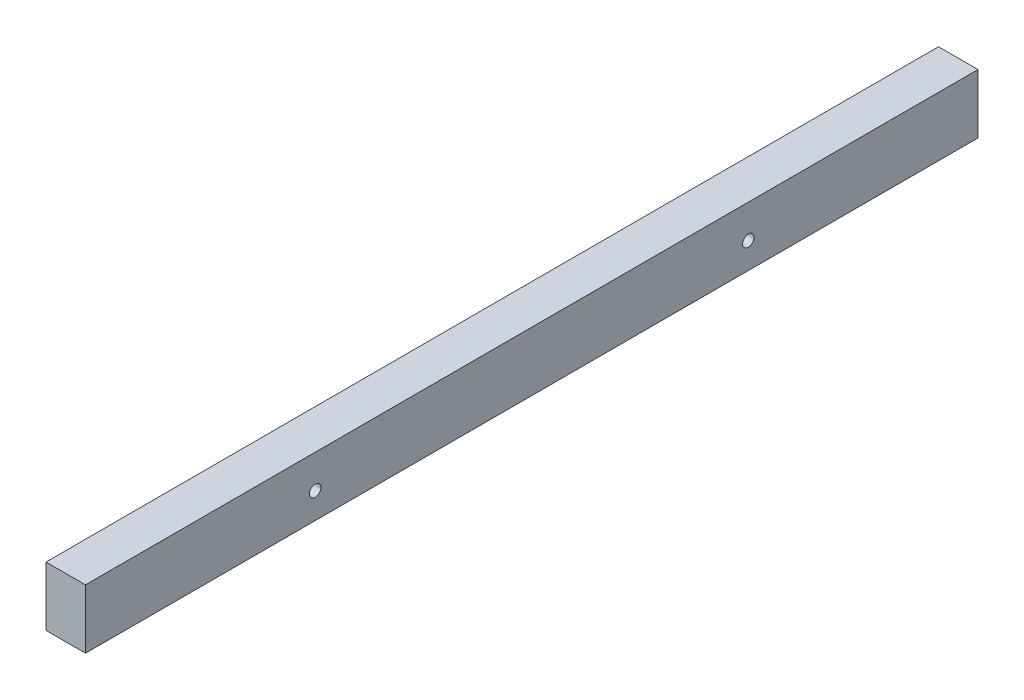
ISO-10303-21;
HEADER;
FILE_DESCRIPTION(('STEP AP214'),'2;1');
FILE_NAME('part.step','',(''),(''),'','','');
FILE_SCHEMA(('AUTOMOTIVE_DESIGN { 1 0 10303 214 1 1 1 1 }'));
ENDSEC;
DATA;
#1=APPLICATION_CONTEXT('core data for automotive mechanical design processes');
#2=APPLICATION_PROTOCOL_DEFINITION('international standard','automotive_design',2000,#1);
#3=PRODUCT_CONTEXT('',#1,'mechanical');
#4=PRODUCT('Part','Part','',(#3));
#5=PRODUCT_RELATED_PRODUCT_CATEGORY('part','',(#4));
#6=PRODUCT_DEFINITION_FORMATION('','',#4);
#7=PRODUCT_DEFINITION_CONTEXT('part definition',#1,'design');
#8=PRODUCT_DEFINITION('design','',#6,#7);
#9=PRODUCT_DEFINITION_SHAPE('','',#8);
#10=(LENGTH_UNIT() NAMED_UNIT(*) SI_UNIT(.MILLI.,.METRE.));
#11=(NAMED_UNIT(*) PLANE_ANGLE_UNIT() SI_UNIT($,.RADIAN.));
#12=(NAMED_UNIT(*) SI_UNIT($,.STERADIAN.) SOLID_ANGLE_UNIT());
#13=UNCERTAINTY_MEASURE_WITH_UNIT(LENGTH_MEASURE(1.E-05),#10,'distance_accuracy_value','');
#14=(GEOMETRIC_REPRESENTATION_CONTEXT(3) GLOBAL_UNCERTAINTY_ASSIGNED_CONTEXT((#13)) GLOBAL_UNIT_ASSIGNED_CONTEXT((#10,
#11,#12)) REPRESENTATION_CONTEXT('',''));
#15=CARTESIAN_POINT('',(0.,0.,0.));
#16=DIRECTION('',(0.,0.,1.));
#17=DIRECTION('',(1.,0.,0.));
#18=AXIS2_PLACEMENT_3D('',#15,#16,#17);
#19=CARTESIAN_POINT('',(0.,0.,287.02));
#20=DIRECTION('',(1.,0.,0.));
#21=DIRECTION('',(0.,0.,-1.));
#22=AXIS2_PLACEMENT_3D('',#19,#20,#21);
#23=PLANE('',#22);
#24=CARTESIAN_POINT('',(0.,8.34314575050762,213.166854249492));
#25=DIRECTION('',(1.,0.,0.));
#26=DIRECTION('',(0.,0.,-1.));
#27=AXIS2_PLACEMENT_3D('',#24,#25,#26);
#28=CIRCLE('',#27,1.85);
#29=CARTESIAN_POINT('',(0.,8.34314575050762,211.316854249492));
#30=VERTEX_POINT('',#29);
#31=EDGE_CURVE('E124',#30,#30,#28,.T.);
#32=ORIENTED_EDGE('',*,*,#31,.T.);
#33=EDGE_LOOP('',(#32));
#34=FACE_BOUND('',#33,.T.);
#35=CARTESIAN_POINT('',(0.,8.34314575050762,73.853145750508));
#36=DIRECTION('',(1.,0.,0.));
#37=DIRECTION('',(0.,0.,-1.));
#38=AXIS2_PLACEMENT_3D('',#35,#36,#37);
#39=CIRCLE('',#38,1.84999999999999);
#40=CARTESIAN_POINT('',(0.,8.34314575050762,72.003145750508));
#41=VERTEX_POINT('',#40);
#42=EDGE_CURVE('E110',#41,#41,#39,.T.);
#43=ORIENTED_EDGE('',*,*,#42,.T.);
#44=EDGE_LOOP('',(#43));
#45=FACE_BOUND('',#44,.T.);
#46=DIRECTION('',(0.,-1.,0.));
#47=VECTOR('',#46,1.);
#48=CARTESIAN_POINT('',(0.,0.,0.));
#49=LINE('',#48,#47);
#50=CARTESIAN_POINT('',(0.,19.05,0.));
#51=VERTEX_POINT('',#50);
#52=CARTESIAN_POINT('',(0.,0.,0.));
#53=VERTEX_POINT('',#52);
#54=EDGE_CURVE('E107',#51,#53,#49,.T.);
#55=ORIENTED_EDGE('',*,*,#54,.T.);
#56=DIRECTION('',(0.,0.,-1.));
#57=VECTOR('',#56,1.);
#58=CARTESIAN_POINT('',(0.,0.,287.02));
#59=LINE('',#58,#57);
#60=CARTESIAN_POINT('',(0.,0.,287.02));
#61=VERTEX_POINT('',#60);
#62=EDGE_CURVE('E13',#61,#53,#59,.T.);
#63=ORIENTED_EDGE('',*,*,#62,.F.);
#64=DIRECTION('',(0.,-1.,0.));
#65=VECTOR('',#64,1.);
#66=CARTESIAN_POINT('',(0.,0.,287.02));
#67=LINE('',#66,#65);
#68=CARTESIAN_POINT('',(0.,19.05,287.02));
#69=VERTEX_POINT('',#68);
#70=EDGE_CURVE('E95',#69,#61,#67,.T.);
#71=ORIENTED_EDGE('',*,*,#70,.F.);
#72=DIRECTION('',(0.,0.,-1.));
#73=VECTOR('',#72,1.);
#74=CARTESIAN_POINT('',(0.,19.05,287.02));
#75=LINE('',#74,#73);
#76=EDGE_CURVE('E103',#69,#51,#75,.T.);
#77=ORIENTED_EDGE('',*,*,#76,.T.);
#78=EDGE_LOOP('',(#55,#63,#71,#77));
#79=FACE_BOUND('',#78,.T.);
#80=ADVANCED_FACE('F44',(#34,#45,#79),#23,.F.);
#81=CARTESIAN_POINT('',(0.,0.,287.02));
#82=DIRECTION('',(0.,1.,0.));
#83=DIRECTION('',(0.,0.,1.));
#84=AXIS2_PLACEMENT_3D('',#81,#82,#83);
#85=PLANE('',#84);
#86=DIRECTION('',(1.,0.,0.));
#87=VECTOR('',#86,1.);
#88=CARTESIAN_POINT('',(0.,0.,0.));
#89=LINE('',#88,#87);
#90=CARTESIAN_POINT('',(12.7,0.,0.));
#91=VERTEX_POINT('',#90);
#92=EDGE_CURVE('E99',#53,#91,#89,.T.);
#93=ORIENTED_EDGE('',*,*,#92,.T.);
#94=DIRECTION('',(0.,0.,-1.));
#95=VECTOR('',#94,1.);
#96=CARTESIAN_POINT('',(12.7,0.,287.02));
#97=LINE('',#96,#95);
#98=CARTESIAN_POINT('',(12.7,0.,287.02));
#99=VERTEX_POINT('',#98);
#100=EDGE_CURVE('E52',#99,#91,#97,.T.);
#101=ORIENTED_EDGE('',*,*,#100,.F.);
#102=DIRECTION('',(1.,0.,0.));
#103=VECTOR('',#102,1.);
#104=CARTESIAN_POINT('',(0.,0.,287.02));
#105=LINE('',#104,#103);
#106=EDGE_CURVE('E90',#61,#99,#105,.T.);
#107=ORIENTED_EDGE('',*,*,#106,.F.);
#108=ORIENTED_EDGE('',*,*,#62,.T.);
#109=EDGE_LOOP('',(#93,#101,#107,#108));
#110=FACE_BOUND('',#109,.T.);
#111=ADVANCED_FACE('F98',(#110),#85,.F.);
#112=CARTESIAN_POINT('',(12.7,0.,287.02));
#113=DIRECTION('',(-1.,0.,0.));
#114=DIRECTION('',(0.,0.,1.));
#115=AXIS2_PLACEMENT_3D('',#112,#113,#114);
#116=PLANE('',#115);
#117=CARTESIAN_POINT('',(12.7,8.34314575050762,213.166854249492));
#118=DIRECTION('',(1.,0.,0.));
#119=DIRECTION('',(0.,0.,-1.));
#120=AXIS2_PLACEMENT_3D('',#117,#118,#119);
#121=CIRCLE('',#120,1.85);
#122=CARTESIAN_POINT('',(12.7,8.34314575050762,211.316854249492));
#123=VERTEX_POINT('',#122);
#124=EDGE_CURVE('E127',#123,#123,#121,.T.);
#125=ORIENTED_EDGE('',*,*,#124,.F.);
#126=EDGE_LOOP('',(#125));
#127=FACE_BOUND('',#126,.T.);
#128=CARTESIAN_POINT('',(12.7,8.34314575050762,73.853145750508));
#129=DIRECTION('',(1.,0.,0.));
#130=DIRECTION('',(0.,0.,-1.));
#131=AXIS2_PLACEMENT_3D('',#128,#129,#130);
#132=CIRCLE('',#131,1.84999999999999);
#133=CARTESIAN_POINT('',(12.7,8.34314575050762,72.003145750508));
#134=VERTEX_POINT('',#133);
#135=EDGE_CURVE('E121',#134,#134,#132,.T.);
#136=ORIENTED_EDGE('',*,*,#135,.F.);
#137=EDGE_LOOP('',(#136));
#138=FACE_BOUND('',#137,.T.);
#139=DIRECTION('',(0.,1.,0.));
#140=VECTOR('',#139,1.);
#141=CARTESIAN_POINT('',(12.7,0.,0.));
#142=LINE('',#141,#140);
#143=CARTESIAN_POINT('',(12.7,19.05,0.));
#144=VERTEX_POINT('',#143);
#145=EDGE_CURVE('E77',#91,#144,#142,.T.);
#146=ORIENTED_EDGE('',*,*,#145,.T.);
#147=DIRECTION('',(0.,0.,-1.));
#148=VECTOR('',#147,1.);
#149=CARTESIAN_POINT('',(12.7,19.05,287.02));
#150=LINE('',#149,#148);
#151=CARTESIAN_POINT('',(12.7,19.05,287.02));
#152=VERTEX_POINT('',#151);
#153=EDGE_CURVE('E100',#152,#144,#150,.T.);
#154=ORIENTED_EDGE('',*,*,#153,.F.);
#155=DIRECTION('',(0.,1.,0.));
#156=VECTOR('',#155,1.);
#157=CARTESIAN_POINT('',(12.7,0.,287.02));
#158=LINE('',#157,#156);
#159=EDGE_CURVE('E93',#99,#152,#158,.T.);
#160=ORIENTED_EDGE('',*,*,#159,.F.);
#161=ORIENTED_EDGE('',*,*,#100,.T.);
#162=EDGE_LOOP('',(#146,#154,#160,#161));
#163=FACE_BOUND('',#162,.T.);
#164=ADVANCED_FACE('F101',(#127,#138,#163),#116,.F.);
#165=CARTESIAN_POINT('',(0.,19.05,287.02));
#166=DIRECTION('',(0.,-1.,0.));
#167=DIRECTION('',(0.,0.,-1.));
#168=AXIS2_PLACEMENT_3D('',#165,#166,#167);
#169=PLANE('',#168);
#170=DIRECTION('',(-1.,0.,0.));
#171=VECTOR('',#170,1.);
#172=CARTESIAN_POINT('',(0.,19.05,0.));
#173=LINE('',#172,#171);
#174=EDGE_CURVE('E83',#144,#51,#173,.T.);
#175=ORIENTED_EDGE('',*,*,#174,.T.);
#176=ORIENTED_EDGE('',*,*,#76,.F.);
#177=DIRECTION('',(-1.,0.,0.));
#178=VECTOR('',#177,1.);
#179=CARTESIAN_POINT('',(0.,19.05,287.02));
#180=LINE('',#179,#178);
#181=EDGE_CURVE('E60',#152,#69,#180,.T.);
#182=ORIENTED_EDGE('',*,*,#181,.F.);
#183=ORIENTED_EDGE('',*,*,#153,.T.);
#184=EDGE_LOOP('',(#175,#176,#182,#183));
#185=FACE_BOUND('',#184,.T.);
#186=ADVANCED_FACE('F115',(#185),#169,.F.);
#187=CARTESIAN_POINT('',(0.,0.,287.02));
#188=DIRECTION('',(0.,0.,-1.));
#189=DIRECTION('',(-1.,0.,0.));
#190=AXIS2_PLACEMENT_3D('',#187,#188,#189);
#191=PLANE('',#190);
#192=ORIENTED_EDGE('',*,*,#70,.T.);
#193=ORIENTED_EDGE('',*,*,#106,.T.);
#194=ORIENTED_EDGE('',*,*,#159,.T.);
#195=ORIENTED_EDGE('',*,*,#181,.T.);
#196=EDGE_LOOP('',(#192,#193,#194,#195));
#197=FACE_BOUND('',#196,.T.);
#198=ADVANCED_FACE('F91',(#197),#191,.F.);
#199=CARTESIAN_POINT('',(0.,0.,0.));
#200=DIRECTION('',(0.,0.,-1.));
#201=DIRECTION('',(-1.,0.,0.));
#202=AXIS2_PLACEMENT_3D('',#199,#200,#201);
#203=PLANE('',#202);
#204=ORIENTED_EDGE('',*,*,#54,.F.);
#205=ORIENTED_EDGE('',*,*,#174,.F.);
#206=ORIENTED_EDGE('',*,*,#145,.F.);
#207=ORIENTED_EDGE('',*,*,#92,.F.);
#208=EDGE_LOOP('',(#204,#205,#206,#207));
#209=FACE_BOUND('',#208,.T.);
#210=ADVANCED_FACE('F118',(#209),#203,.T.);
#211=CARTESIAN_POINT('',(0.,8.34314575050762,73.853145750508));
#212=DIRECTION('',(1.,0.,0.));
#213=DIRECTION('',(0.,0.,-1.));
#214=AXIS2_PLACEMENT_3D('',#211,#212,#213);
#215=CYLINDRICAL_SURFACE('',#214,1.84999999999999);
#216=ORIENTED_EDGE('',*,*,#42,.F.);
#217=EDGE_LOOP('',(#216));
#218=FACE_BOUND('',#217,.T.);
#219=ORIENTED_EDGE('',*,*,#135,.T.);
#220=EDGE_LOOP('',(#219));
#221=FACE_BOUND('',#220,.T.);
#222=ADVANCED_FACE('F138',(#218,#221),#215,.F.);
#223=CARTESIAN_POINT('',(0.,8.34314575050762,213.166854249492));
#224=DIRECTION('',(1.,0.,0.));
#225=DIRECTION('',(0.,0.,-1.));
#226=AXIS2_PLACEMENT_3D('',#223,#224,#225);
#227=CYLINDRICAL_SURFACE('',#226,1.85);
#228=ORIENTED_EDGE('',*,*,#31,.F.);
#229=EDGE_LOOP('',(#228));
#230=FACE_BOUND('',#229,.T.);
#231=ORIENTED_EDGE('',*,*,#124,.T.);
#232=EDGE_LOOP('',(#231));
#233=FACE_BOUND('',#232,.T.);
#234=ADVANCED_FACE('F135',(#230,#233),#227,.F.);
#235=CLOSED_SHELL('',(#80,#111,#164,#186,#198,#210,#222,#234));
#236=MANIFOLD_SOLID_BREP('B2',#235);
#237=ADVANCED_BREP_SHAPE_REPRESENTATION('',(#18,#236),#14);
#238=SHAPE_DEFINITION_REPRESENTATION(#9,#237);
ENDSEC;
END-ISO-10303-21;
